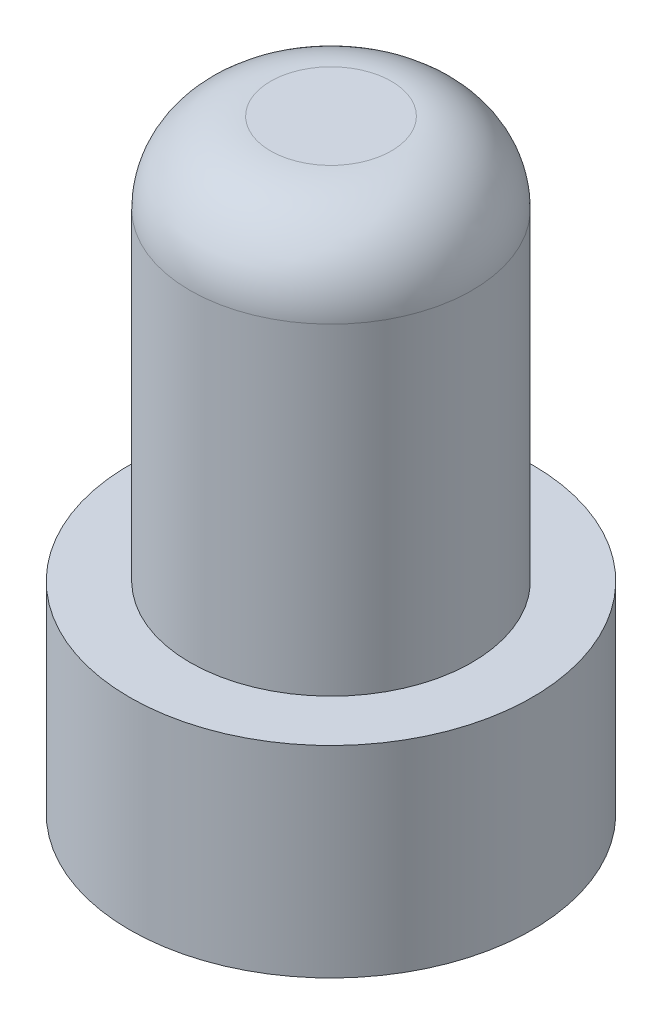
ISO-10303-21;
HEADER;
FILE_DESCRIPTION(('STEP AP214'),'2;1');
FILE_NAME('part.step','',(''),(''),'','','');
FILE_SCHEMA(('AUTOMOTIVE_DESIGN { 1 0 10303 214 1 1 1 1 }'));
ENDSEC;
DATA;
#1=APPLICATION_CONTEXT('core data for automotive mechanical design processes');
#2=APPLICATION_PROTOCOL_DEFINITION('international standard','automotive_design',2000,#1);
#3=PRODUCT_CONTEXT('',#1,'mechanical');
#4=PRODUCT('Part','Part','',(#3));
#5=PRODUCT_RELATED_PRODUCT_CATEGORY('part','',(#4));
#6=PRODUCT_DEFINITION_FORMATION('','',#4);
#7=PRODUCT_DEFINITION_CONTEXT('part definition',#1,'design');
#8=PRODUCT_DEFINITION('design','',#6,#7);
#9=PRODUCT_DEFINITION_SHAPE('','',#8);
#10=(LENGTH_UNIT() NAMED_UNIT(*) SI_UNIT(.MILLI.,.METRE.));
#11=(NAMED_UNIT(*) PLANE_ANGLE_UNIT() SI_UNIT($,.RADIAN.));
#12=(NAMED_UNIT(*) SI_UNIT($,.STERADIAN.) SOLID_ANGLE_UNIT());
#13=UNCERTAINTY_MEASURE_WITH_UNIT(LENGTH_MEASURE(1.E-05),#10,'distance_accuracy_value','');
#14=(GEOMETRIC_REPRESENTATION_CONTEXT(3) GLOBAL_UNCERTAINTY_ASSIGNED_CONTEXT((#13)) GLOBAL_UNIT_ASSIGNED_CONTEXT((#10,
#11,#12)) REPRESENTATION_CONTEXT('',''));
#15=CARTESIAN_POINT('',(0.,0.,0.));
#16=DIRECTION('',(0.,0.,1.));
#17=DIRECTION('',(1.,0.,0.));
#18=AXIS2_PLACEMENT_3D('',#15,#16,#17);
#19=CARTESIAN_POINT('',(0.,2.5,0.));
#20=DIRECTION('',(0.,-1.,0.));
#21=DIRECTION('',(0.,0.,-1.));
#22=AXIS2_PLACEMENT_3D('',#19,#20,#21);
#23=CYLINDRICAL_SURFACE('',#22,2.5);
#24=CARTESIAN_POINT('',(0.,2.5,0.));
#25=DIRECTION('',(0.,1.,0.));
#26=DIRECTION('',(0.,0.,1.));
#27=AXIS2_PLACEMENT_3D('',#24,#25,#26);
#28=CIRCLE('',#27,2.5);
#29=CARTESIAN_POINT('',(0.,2.5,2.5));
#30=VERTEX_POINT('',#29);
#31=EDGE_CURVE('E51',#30,#30,#28,.T.);
#32=ORIENTED_EDGE('',*,*,#31,.F.);
#33=EDGE_LOOP('',(#32));
#34=FACE_BOUND('',#33,.T.);
#35=CARTESIAN_POINT('',(0.,0.,0.));
#36=DIRECTION('',(0.,1.,0.));
#37=DIRECTION('',(0.,0.,1.));
#38=AXIS2_PLACEMENT_3D('',#35,#36,#37);
#39=CIRCLE('',#38,2.5);
#40=CARTESIAN_POINT('',(0.,0.,2.5));
#41=VERTEX_POINT('',#40);
#42=EDGE_CURVE('E54',#41,#41,#39,.T.);
#43=ORIENTED_EDGE('',*,*,#42,.T.);
#44=EDGE_LOOP('',(#43));
#45=FACE_BOUND('',#44,.T.);
#46=ADVANCED_FACE('F36',(#34,#45),#23,.T.);
#47=CARTESIAN_POINT('',(0.,2.5,0.));
#48=DIRECTION('',(0.,1.,0.));
#49=DIRECTION('',(0.,0.,1.));
#50=AXIS2_PLACEMENT_3D('',#47,#48,#49);
#51=PLANE('',#50);
#52=CARTESIAN_POINT('',(0.,2.5,0.));
#53=DIRECTION('',(0.,1.,0.));
#54=DIRECTION('',(0.,0.,1.));
#55=AXIS2_PLACEMENT_3D('',#52,#53,#54);
#56=CIRCLE('',#55,1.75);
#57=CARTESIAN_POINT('',(0.,2.5,1.75));
#58=VERTEX_POINT('',#57);
#59=EDGE_CURVE('E47',#58,#58,#56,.T.);
#60=ORIENTED_EDGE('',*,*,#59,.F.);
#61=EDGE_LOOP('',(#60));
#62=FACE_BOUND('',#61,.T.);
#63=ORIENTED_EDGE('',*,*,#31,.T.);
#64=EDGE_LOOP('',(#63));
#65=FACE_BOUND('',#64,.T.);
#66=ADVANCED_FACE('F60',(#62,#65),#51,.T.);
#67=CARTESIAN_POINT('',(0.,0.,0.));
#68=DIRECTION('',(0.,1.,0.));
#69=DIRECTION('',(0.,0.,1.));
#70=AXIS2_PLACEMENT_3D('',#67,#68,#69);
#71=PLANE('',#70);
#72=ORIENTED_EDGE('',*,*,#42,.F.);
#73=EDGE_LOOP('',(#72));
#74=FACE_BOUND('',#73,.T.);
#75=ADVANCED_FACE('F66',(#74),#71,.F.);
#76=CARTESIAN_POINT('',(0.,7.5,0.));
#77=DIRECTION('',(0.,-1.,0.));
#78=DIRECTION('',(0.,0.,-1.));
#79=AXIS2_PLACEMENT_3D('',#76,#77,#78);
#80=CYLINDRICAL_SURFACE('',#79,1.75);
#81=CARTESIAN_POINT('',(0.,6.5,0.));
#82=DIRECTION('',(0.,1.,0.));
#83=DIRECTION('',(0.,0.,1.));
#84=AXIS2_PLACEMENT_3D('',#81,#82,#83);
#85=CIRCLE('',#84,1.75);
#86=CARTESIAN_POINT('',(0.,6.5,1.75));
#87=VERTEX_POINT('',#86);
#88=EDGE_CURVE('E10',#87,#87,#85,.F.);
#89=ORIENTED_EDGE('',*,*,#88,.T.);
#90=EDGE_LOOP('',(#89));
#91=FACE_BOUND('',#90,.T.);
#92=ORIENTED_EDGE('',*,*,#59,.T.);
#93=EDGE_LOOP('',(#92));
#94=FACE_BOUND('',#93,.T.);
#95=ADVANCED_FACE('F68',(#91,#94),#80,.T.);
#96=CARTESIAN_POINT('',(0.,7.5,0.));
#97=DIRECTION('',(0.,1.,0.));
#98=DIRECTION('',(0.,0.,1.));
#99=AXIS2_PLACEMENT_3D('',#96,#97,#98);
#100=PLANE('',#99);
#101=CARTESIAN_POINT('',(0.,7.5,0.));
#102=DIRECTION('',(0.,1.,0.));
#103=DIRECTION('',(0.,0.,1.));
#104=AXIS2_PLACEMENT_3D('',#101,#102,#103);
#105=CIRCLE('',#104,0.75);
#106=CARTESIAN_POINT('',(0.,7.5,0.75));
#107=VERTEX_POINT('',#106);
#108=EDGE_CURVE('E43',#107,#107,#105,.T.);
#109=ORIENTED_EDGE('',*,*,#108,.T.);
#110=EDGE_LOOP('',(#109));
#111=FACE_BOUND('',#110,.T.);
#112=ADVANCED_FACE('F74',(#111),#100,.T.);
#113=CARTESIAN_POINT('',(0.,6.5,0.));
#114=DIRECTION('',(0.,1.,0.));
#115=DIRECTION('',(0.,0.,1.));
#116=AXIS2_PLACEMENT_3D('',#113,#114,#115);
#117=DEGENERATE_TOROIDAL_SURFACE('',#116,0.75,1.,.T.);
#118=ORIENTED_EDGE('',*,*,#88,.F.);
#119=EDGE_LOOP('',(#118));
#120=FACE_BOUND('',#119,.T.);
#121=ORIENTED_EDGE('',*,*,#108,.F.);
#122=EDGE_LOOP('',(#121));
#123=FACE_BOUND('',#122,.T.);
#124=ADVANCED_FACE('F38',(#120,#123),#117,.T.);
#125=CLOSED_SHELL('',(#46,#66,#75,#95,#112,#124));
#126=MANIFOLD_SOLID_BREP('B2',#125);
#127=ADVANCED_BREP_SHAPE_REPRESENTATION('',(#18,#126),#14);
#128=SHAPE_DEFINITION_REPRESENTATION(#9,#127);
ENDSEC;
END-ISO-10303-21;
